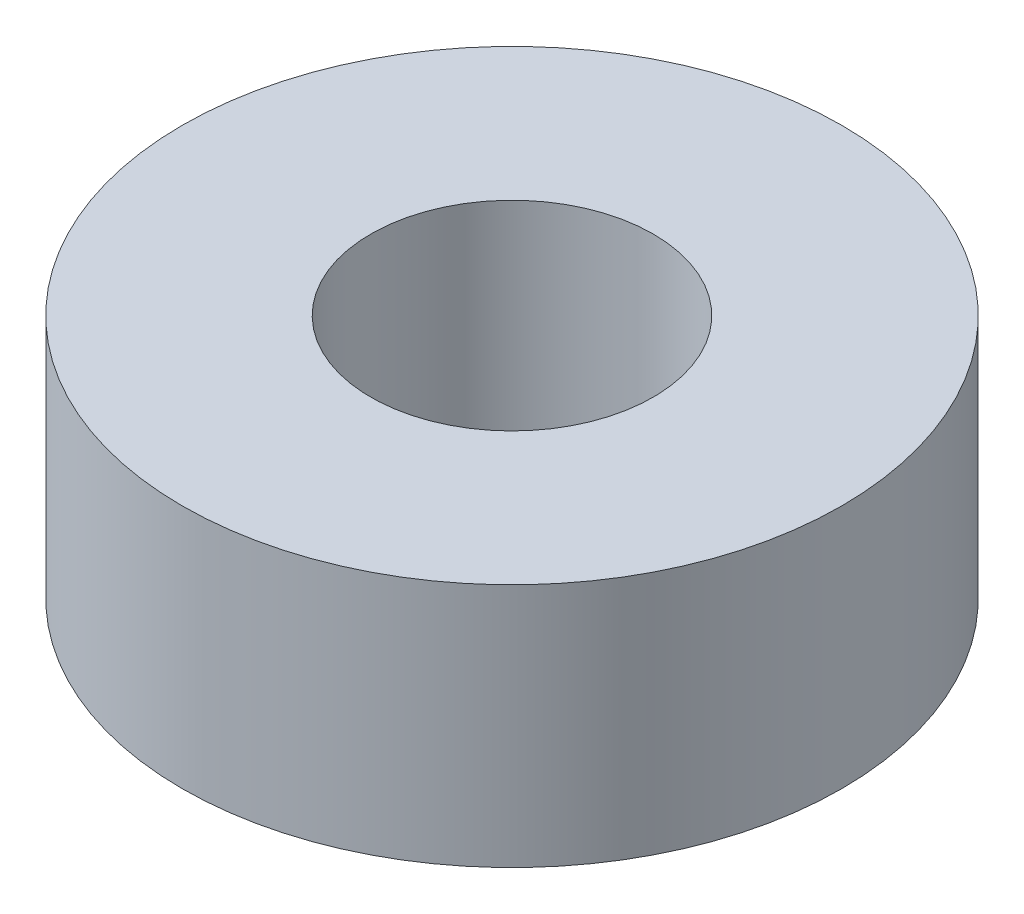
ISO-10303-21;
HEADER;
FILE_DESCRIPTION(('STEP AP214'),'2;1');
FILE_NAME('part.step','',(''),(''),'','','');
FILE_SCHEMA(('AUTOMOTIVE_DESIGN { 1 0 10303 214 1 1 1 1 }'));
ENDSEC;
DATA;
#1=APPLICATION_CONTEXT('core data for automotive mechanical design processes');
#2=APPLICATION_PROTOCOL_DEFINITION('international standard','automotive_design',2000,#1);
#3=PRODUCT_CONTEXT('',#1,'mechanical');
#4=PRODUCT('Part','Part','',(#3));
#5=PRODUCT_RELATED_PRODUCT_CATEGORY('part','',(#4));
#6=PRODUCT_DEFINITION_FORMATION('','',#4);
#7=PRODUCT_DEFINITION_CONTEXT('part definition',#1,'design');
#8=PRODUCT_DEFINITION('design','',#6,#7);
#9=PRODUCT_DEFINITION_SHAPE('','',#8);
#10=(LENGTH_UNIT() NAMED_UNIT(*) SI_UNIT(.MILLI.,.METRE.));
#11=(NAMED_UNIT(*) PLANE_ANGLE_UNIT() SI_UNIT($,.RADIAN.));
#12=(NAMED_UNIT(*) SI_UNIT($,.STERADIAN.) SOLID_ANGLE_UNIT());
#13=UNCERTAINTY_MEASURE_WITH_UNIT(LENGTH_MEASURE(1.E-05),#10,'distance_accuracy_value','');
#14=(GEOMETRIC_REPRESENTATION_CONTEXT(3) GLOBAL_UNCERTAINTY_ASSIGNED_CONTEXT((#13)) GLOBAL_UNIT_ASSIGNED_CONTEXT((#10,
#11,#12)) REPRESENTATION_CONTEXT('',''));
#15=CARTESIAN_POINT('',(0.,0.,0.));
#16=DIRECTION('',(0.,0.,1.));
#17=DIRECTION('',(1.,0.,0.));
#18=AXIS2_PLACEMENT_3D('',#15,#16,#17);
#19=CARTESIAN_POINT('',(0.,13.,0.));
#20=DIRECTION('',(0.,-1.,0.));
#21=DIRECTION('',(0.,0.,-1.));
#22=AXIS2_PLACEMENT_3D('',#19,#20,#21);
#23=CYLINDRICAL_SURFACE('',#22,17.5);
#24=CARTESIAN_POINT('',(0.,13.,0.));
#25=DIRECTION('',(0.,1.,0.));
#26=DIRECTION('',(0.,0.,1.));
#27=AXIS2_PLACEMENT_3D('',#24,#25,#26);
#28=CIRCLE('',#27,17.5);
#29=CARTESIAN_POINT('',(0.,13.,-17.5));
#30=VERTEX_POINT('',#29);
#31=EDGE_CURVE('E10',#30,#30,#28,.T.);
#32=CARTESIAN_POINT('',(0.,0.,0.));
#33=DIRECTION('',(0.,1.,0.));
#34=DIRECTION('',(0.,0.,1.));
#35=AXIS2_PLACEMENT_3D('',#32,#33,#34);
#36=CIRCLE('',#35,17.5);
#37=CARTESIAN_POINT('',(0.,0.,-17.5));
#38=VERTEX_POINT('',#37);
#39=EDGE_CURVE('E37',#38,#38,#36,.T.);
#40=CARTESIAN_POINT('',(0.,13.,-17.5));
#41=CARTESIAN_POINT('',(0.,12.8645833333333,-17.5));
#42=CARTESIAN_POINT('',(0.,12.7291666666667,-17.5));
#43=CARTESIAN_POINT('',(0.,12.4583333333333,-17.5));
#44=CARTESIAN_POINT('',(0.,12.3229166666667,-17.5));
#45=CARTESIAN_POINT('',(0.,12.0520833333333,-17.5));
#46=CARTESIAN_POINT('',(0.,11.9166666666667,-17.5));
#47=CARTESIAN_POINT('',(0.,11.6458333333333,-17.5));
#48=CARTESIAN_POINT('',(0.,11.5104166666667,-17.5));
#49=CARTESIAN_POINT('',(0.,11.2395833333333,-17.5));
#50=CARTESIAN_POINT('',(0.,11.1041666666667,-17.5));
#51=CARTESIAN_POINT('',(0.,10.8333333333333,-17.5));
#52=CARTESIAN_POINT('',(0.,10.6979166666667,-17.5));
#53=CARTESIAN_POINT('',(0.,10.4270833333333,-17.5));
#54=CARTESIAN_POINT('',(0.,10.2916666666667,-17.5));
#55=CARTESIAN_POINT('',(0.,10.0208333333333,-17.5));
#56=CARTESIAN_POINT('',(0.,9.88541666666667,-17.5));
#57=CARTESIAN_POINT('',(0.,9.61458333333333,-17.5));
#58=CARTESIAN_POINT('',(0.,9.47916666666667,-17.5));
#59=CARTESIAN_POINT('',(0.,9.20833333333333,-17.5));
#60=CARTESIAN_POINT('',(0.,9.07291666666667,-17.5));
#61=CARTESIAN_POINT('',(0.,8.80208333333333,-17.5));
#62=CARTESIAN_POINT('',(0.,8.66666666666667,-17.5));
#63=CARTESIAN_POINT('',(0.,8.39583333333333,-17.5));
#64=CARTESIAN_POINT('',(0.,8.26041666666667,-17.5));
#65=CARTESIAN_POINT('',(0.,7.98958333333333,-17.5));
#66=CARTESIAN_POINT('',(0.,7.85416666666667,-17.5));
#67=CARTESIAN_POINT('',(0.,7.58333333333333,-17.5));
#68=CARTESIAN_POINT('',(0.,7.44791666666667,-17.5));
#69=CARTESIAN_POINT('',(0.,7.17708333333333,-17.5));
#70=CARTESIAN_POINT('',(0.,7.04166666666667,-17.5));
#71=CARTESIAN_POINT('',(0.,6.77083333333333,-17.5));
#72=CARTESIAN_POINT('',(0.,6.63541666666667,-17.5));
#73=CARTESIAN_POINT('',(0.,6.36458333333333,-17.5));
#74=CARTESIAN_POINT('',(0.,6.22916666666667,-17.5));
#75=CARTESIAN_POINT('',(0.,5.95833333333333,-17.5));
#76=CARTESIAN_POINT('',(0.,5.82291666666667,-17.5));
#77=CARTESIAN_POINT('',(0.,5.55208333333333,-17.5));
#78=CARTESIAN_POINT('',(0.,5.41666666666667,-17.5));
#79=CARTESIAN_POINT('',(0.,5.14583333333333,-17.5));
#80=CARTESIAN_POINT('',(0.,5.01041666666667,-17.5));
#81=CARTESIAN_POINT('',(0.,4.73958333333333,-17.5));
#82=CARTESIAN_POINT('',(0.,4.60416666666667,-17.5));
#83=CARTESIAN_POINT('',(0.,4.33333333333333,-17.5));
#84=CARTESIAN_POINT('',(0.,4.19791666666667,-17.5));
#85=CARTESIAN_POINT('',(0.,3.92708333333333,-17.5));
#86=CARTESIAN_POINT('',(0.,3.79166666666667,-17.5));
#87=CARTESIAN_POINT('',(0.,3.52083333333333,-17.5));
#88=CARTESIAN_POINT('',(0.,3.38541666666667,-17.5));
#89=CARTESIAN_POINT('',(0.,3.11458333333333,-17.5));
#90=CARTESIAN_POINT('',(0.,2.97916666666667,-17.5));
#91=CARTESIAN_POINT('',(0.,2.70833333333333,-17.5));
#92=CARTESIAN_POINT('',(0.,2.57291666666667,-17.5));
#93=CARTESIAN_POINT('',(0.,2.30208333333333,-17.5));
#94=CARTESIAN_POINT('',(0.,2.16666666666667,-17.5));
#95=CARTESIAN_POINT('',(0.,1.89583333333333,-17.5));
#96=CARTESIAN_POINT('',(0.,1.76041666666667,-17.5));
#97=CARTESIAN_POINT('',(0.,1.48958333333333,-17.5));
#98=CARTESIAN_POINT('',(0.,1.35416666666667,-17.5));
#99=CARTESIAN_POINT('',(0.,1.08333333333333,-17.5));
#100=CARTESIAN_POINT('',(0.,0.947916666666667,-17.5));
#101=CARTESIAN_POINT('',(0.,0.677083333333334,-17.5));
#102=CARTESIAN_POINT('',(0.,0.541666666666667,-17.5));
#103=CARTESIAN_POINT('',(0.,0.270833333333334,-17.5));
#104=CARTESIAN_POINT('',(0.,0.135416666666667,-17.5));
#105=CARTESIAN_POINT('',(0.,0.,-17.5));
#106=B_SPLINE_CURVE_WITH_KNOTS('',3,(#40,#41,#42,#43,#44,#45,#46,#47,#48,#49,#50,#51,#52,#53,
#54,#55,#56,#57,#58,#59,#60,#61,#62,#63,#64,#65,#66,#67,#68,#69,#70,#71,#72,#73,#74,#75,#76,#77,
#78,#79,#80,#81,#82,#83,#84,#85,#86,#87,#88,#89,#90,#91,#92,#93,#94,#95,#96,#97,#98,#99,#100,
#101,#102,#103,#104,#105),.UNSPECIFIED.,.F.,.F.,(4,2,2,2,2,2,2,2,2,2,2,2,2,2,2,2,2,2,2,2,2,2,2,
2,2,2,2,2,2,2,2,2,4),(0.,0.406249999999999,0.812499999999999,1.21875,1.625,2.03125,2.4375,
2.84375,3.25,3.65625,4.0625,4.46875,4.875,5.28125,5.6875,6.09375,6.5,6.90625,7.3125,7.71875,
8.125,8.53125,8.9375,9.34375,9.75,10.15625,10.5625,10.96875,11.375,11.78125,12.1875,12.59375,
13.),.UNSPECIFIED.);
#107=EDGE_CURVE('BSEAM40',#30,#38,#106,.T.);
#108=ORIENTED_EDGE('',*,*,#31,.F.);
#109=ORIENTED_EDGE('',*,*,#39,.T.);
#110=ORIENTED_EDGE('',*,*,#107,.T.);
#111=ORIENTED_EDGE('',*,*,#107,.F.);
#112=EDGE_LOOP('',(#108,#110,#109,#111));
#113=FACE_BOUND('',#112,.T.);
#114=ADVANCED_FACE('F40',(#113),#23,.T.);
#115=CARTESIAN_POINT('',(0.,13.,0.));
#116=DIRECTION('',(0.,1.,0.));
#117=DIRECTION('',(0.,0.,1.));
#118=AXIS2_PLACEMENT_3D('',#115,#116,#117);
#119=PLANE('',#118);
#120=CARTESIAN_POINT('',(0.,13.,0.));
#121=DIRECTION('',(0.,1.,0.));
#122=DIRECTION('',(0.,0.,1.));
#123=AXIS2_PLACEMENT_3D('',#120,#121,#122);
#124=CIRCLE('',#123,7.5);
#125=CARTESIAN_POINT('',(0.,13.,-7.5));
#126=VERTEX_POINT('',#125);
#127=EDGE_CURVE('E50',#126,#126,#124,.T.);
#128=ORIENTED_EDGE('',*,*,#127,.F.);
#129=EDGE_LOOP('',(#128));
#130=FACE_BOUND('',#129,.T.);
#131=ORIENTED_EDGE('',*,*,#31,.T.);
#132=EDGE_LOOP('',(#131));
#133=FACE_BOUND('',#132,.T.);
#134=ADVANCED_FACE('F59',(#130,#133),#119,.T.);
#135=CARTESIAN_POINT('',(0.,0.,0.));
#136=DIRECTION('',(0.,1.,0.));
#137=DIRECTION('',(0.,0.,1.));
#138=AXIS2_PLACEMENT_3D('',#135,#136,#137);
#139=PLANE('',#138);
#140=CARTESIAN_POINT('',(0.,0.,0.));
#141=DIRECTION('',(0.,1.,0.));
#142=DIRECTION('',(0.,0.,1.));
#143=AXIS2_PLACEMENT_3D('',#140,#141,#142);
#144=CIRCLE('',#143,7.5);
#145=CARTESIAN_POINT('',(0.,0.,-7.5));
#146=VERTEX_POINT('',#145);
#147=EDGE_CURVE('E47',#146,#146,#144,.T.);
#148=ORIENTED_EDGE('',*,*,#147,.T.);
#149=EDGE_LOOP('',(#148));
#150=FACE_BOUND('',#149,.T.);
#151=ORIENTED_EDGE('',*,*,#39,.F.);
#152=EDGE_LOOP('',(#151));
#153=FACE_BOUND('',#152,.T.);
#154=ADVANCED_FACE('F58',(#150,#153),#139,.F.);
#155=CARTESIAN_POINT('',(0.,13.,0.));
#156=DIRECTION('',(0.,-1.,0.));
#157=DIRECTION('',(0.,0.,-1.));
#158=AXIS2_PLACEMENT_3D('',#155,#156,#157);
#159=CYLINDRICAL_SURFACE('',#158,7.5);
#160=CARTESIAN_POINT('',(0.,13.,-7.5));
#161=CARTESIAN_POINT('',(0.,12.8645833333333,-7.5));
#162=CARTESIAN_POINT('',(0.,12.7291666666667,-7.5));
#163=CARTESIAN_POINT('',(0.,12.4583333333333,-7.5));
#164=CARTESIAN_POINT('',(0.,12.3229166666667,-7.5));
#165=CARTESIAN_POINT('',(0.,12.0520833333333,-7.5));
#166=CARTESIAN_POINT('',(0.,11.9166666666667,-7.5));
#167=CARTESIAN_POINT('',(0.,11.6458333333333,-7.5));
#168=CARTESIAN_POINT('',(0.,11.5104166666667,-7.5));
#169=CARTESIAN_POINT('',(0.,11.2395833333333,-7.5));
#170=CARTESIAN_POINT('',(0.,11.1041666666667,-7.5));
#171=CARTESIAN_POINT('',(0.,10.8333333333333,-7.5));
#172=CARTESIAN_POINT('',(0.,10.6979166666667,-7.5));
#173=CARTESIAN_POINT('',(0.,10.4270833333333,-7.5));
#174=CARTESIAN_POINT('',(0.,10.2916666666667,-7.5));
#175=CARTESIAN_POINT('',(0.,10.0208333333333,-7.5));
#176=CARTESIAN_POINT('',(0.,9.88541666666667,-7.5));
#177=CARTESIAN_POINT('',(0.,9.61458333333333,-7.5));
#178=CARTESIAN_POINT('',(0.,9.47916666666667,-7.5));
#179=CARTESIAN_POINT('',(0.,9.20833333333333,-7.5));
#180=CARTESIAN_POINT('',(0.,9.07291666666666,-7.5));
#181=CARTESIAN_POINT('',(0.,8.80208333333333,-7.5));
#182=CARTESIAN_POINT('',(0.,8.66666666666667,-7.5));
#183=CARTESIAN_POINT('',(0.,8.39583333333333,-7.5));
#184=CARTESIAN_POINT('',(0.,8.26041666666667,-7.5));
#185=CARTESIAN_POINT('',(0.,7.98958333333333,-7.5));
#186=CARTESIAN_POINT('',(0.,7.85416666666667,-7.5));
#187=CARTESIAN_POINT('',(0.,7.58333333333333,-7.5));
#188=CARTESIAN_POINT('',(0.,7.44791666666667,-7.5));
#189=CARTESIAN_POINT('',(0.,7.17708333333333,-7.5));
#190=CARTESIAN_POINT('',(0.,7.04166666666667,-7.5));
#191=CARTESIAN_POINT('',(0.,6.77083333333333,-7.5));
#192=CARTESIAN_POINT('',(0.,6.63541666666667,-7.5));
#193=CARTESIAN_POINT('',(0.,6.36458333333333,-7.5));
#194=CARTESIAN_POINT('',(0.,6.22916666666667,-7.5));
#195=CARTESIAN_POINT('',(0.,5.95833333333333,-7.5));
#196=CARTESIAN_POINT('',(0.,5.82291666666667,-7.5));
#197=CARTESIAN_POINT('',(0.,5.55208333333333,-7.5));
#198=CARTESIAN_POINT('',(0.,5.41666666666667,-7.5));
#199=CARTESIAN_POINT('',(0.,5.14583333333333,-7.5));
#200=CARTESIAN_POINT('',(0.,5.01041666666667,-7.5));
#201=CARTESIAN_POINT('',(0.,4.73958333333333,-7.5));
#202=CARTESIAN_POINT('',(0.,4.60416666666667,-7.5));
#203=CARTESIAN_POINT('',(0.,4.33333333333333,-7.5));
#204=CARTESIAN_POINT('',(0.,4.19791666666667,-7.5));
#205=CARTESIAN_POINT('',(0.,3.92708333333333,-7.5));
#206=CARTESIAN_POINT('',(0.,3.79166666666667,-7.5));
#207=CARTESIAN_POINT('',(0.,3.52083333333333,-7.5));
#208=CARTESIAN_POINT('',(0.,3.38541666666667,-7.5));
#209=CARTESIAN_POINT('',(0.,3.11458333333333,-7.5));
#210=CARTESIAN_POINT('',(0.,2.97916666666667,-7.5));
#211=CARTESIAN_POINT('',(0.,2.70833333333333,-7.5));
#212=CARTESIAN_POINT('',(0.,2.57291666666667,-7.5));
#213=CARTESIAN_POINT('',(0.,2.30208333333333,-7.5));
#214=CARTESIAN_POINT('',(0.,2.16666666666667,-7.5));
#215=CARTESIAN_POINT('',(0.,1.89583333333333,-7.5));
#216=CARTESIAN_POINT('',(0.,1.76041666666667,-7.5));
#217=CARTESIAN_POINT('',(0.,1.48958333333333,-7.5));
#218=CARTESIAN_POINT('',(0.,1.35416666666667,-7.5));
#219=CARTESIAN_POINT('',(0.,1.08333333333333,-7.5));
#220=CARTESIAN_POINT('',(0.,0.947916666666667,-7.5));
#221=CARTESIAN_POINT('',(0.,0.677083333333334,-7.5));
#222=CARTESIAN_POINT('',(0.,0.541666666666667,-7.5));
#223=CARTESIAN_POINT('',(0.,0.270833333333334,-7.5));
#224=CARTESIAN_POINT('',(0.,0.135416666666667,-7.5));
#225=CARTESIAN_POINT('',(0.,0.,-7.5));
#226=B_SPLINE_CURVE_WITH_KNOTS('',3,(#160,#161,#162,#163,#164,#165,#166,#167,#168,#169,#170,
#171,#172,#173,#174,#175,#176,#177,#178,#179,#180,#181,#182,#183,#184,#185,#186,#187,#188,#189,
#190,#191,#192,#193,#194,#195,#196,#197,#198,#199,#200,#201,#202,#203,#204,#205,#206,#207,#208,
#209,#210,#211,#212,#213,#214,#215,#216,#217,#218,#219,#220,#221,#222,#223,#224,#225),
.UNSPECIFIED.,.F.,.F.,(4,2,2,2,2,2,2,2,2,2,2,2,2,2,2,2,2,2,2,2,2,2,2,2,2,2,2,2,2,2,2,2,4),(0.,
0.40625,0.812500000000001,1.21875,1.625,2.03125,2.4375,2.84375,3.25,3.65625,4.0625,4.46875,
4.875,5.28125,5.6875,6.09375,6.5,6.90625,7.3125,7.71875,8.125,8.53125,8.9375,9.34375,9.75,
10.15625,10.5625,10.96875,11.375,11.78125,12.1875,12.59375,13.),.UNSPECIFIED.);
#227=EDGE_CURVE('BSEAM54',#126,#146,#226,.T.);
#228=ORIENTED_EDGE('',*,*,#127,.T.);
#229=ORIENTED_EDGE('',*,*,#147,.F.);
#230=ORIENTED_EDGE('',*,*,#227,.T.);
#231=ORIENTED_EDGE('',*,*,#227,.F.);
#232=EDGE_LOOP('',(#228,#230,#229,#231));
#233=FACE_BOUND('',#232,.T.);
#234=ADVANCED_FACE('F54',(#233),#159,.F.);
#235=CLOSED_SHELL('',(#114,#134,#154,#234));
#236=MANIFOLD_SOLID_BREP('B2',#235);
#237=ADVANCED_BREP_SHAPE_REPRESENTATION('',(#18,#236),#14);
#238=SHAPE_DEFINITION_REPRESENTATION(#9,#237);
ENDSEC;
END-ISO-10303-21;
